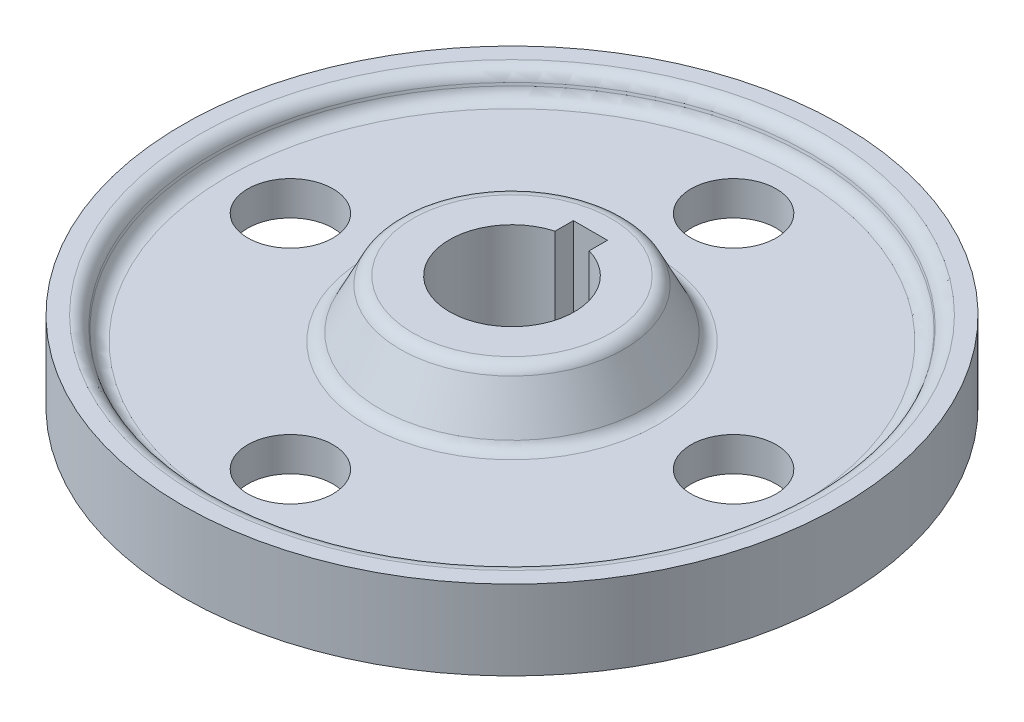
ISO-10303-21;
HEADER;
FILE_DESCRIPTION(('STEP AP214'),'2;1');
FILE_NAME('part.step','',(''),(''),'','','');
FILE_SCHEMA(('AUTOMOTIVE_DESIGN { 1 0 10303 214 1 1 1 1 }'));
ENDSEC;
DATA;
#1=APPLICATION_CONTEXT('core data for automotive mechanical design processes');
#2=APPLICATION_PROTOCOL_DEFINITION('international standard','automotive_design',2000,#1);
#3=PRODUCT_CONTEXT('',#1,'mechanical');
#4=PRODUCT('Part','Part','',(#3));
#5=PRODUCT_RELATED_PRODUCT_CATEGORY('part','',(#4));
#6=PRODUCT_DEFINITION_FORMATION('','',#4);
#7=PRODUCT_DEFINITION_CONTEXT('part definition',#1,'design');
#8=PRODUCT_DEFINITION('design','',#6,#7);
#9=PRODUCT_DEFINITION_SHAPE('','',#8);
#10=(LENGTH_UNIT() NAMED_UNIT(*) SI_UNIT(.MILLI.,.METRE.));
#11=(NAMED_UNIT(*) PLANE_ANGLE_UNIT() SI_UNIT($,.RADIAN.));
#12=(NAMED_UNIT(*) SI_UNIT($,.STERADIAN.) SOLID_ANGLE_UNIT());
#13=UNCERTAINTY_MEASURE_WITH_UNIT(LENGTH_MEASURE(1.E-05),#10,'distance_accuracy_value','');
#14=(GEOMETRIC_REPRESENTATION_CONTEXT(3) GLOBAL_UNCERTAINTY_ASSIGNED_CONTEXT((#13)) GLOBAL_UNIT_ASSIGNED_CONTEXT((#10,
#11,#12)) REPRESENTATION_CONTEXT('',''));
#15=CARTESIAN_POINT('',(0.,0.,0.));
#16=DIRECTION('',(0.,0.,1.));
#17=DIRECTION('',(1.,0.,0.));
#18=AXIS2_PLACEMENT_3D('',#15,#16,#17);
#19=CARTESIAN_POINT('',(0.,13.,0.));
#20=DIRECTION('',(0.,-1.,0.));
#21=DIRECTION('',(0.,0.,-1.));
#22=AXIS2_PLACEMENT_3D('',#19,#20,#21);
#23=CYLINDRICAL_SURFACE('',#22,58.);
#24=CARTESIAN_POINT('',(0.,7.,0.));
#25=DIRECTION('',(0.,1.,0.));
#26=DIRECTION('',(0.,0.,1.));
#27=AXIS2_PLACEMENT_3D('',#24,#25,#26);
#28=CIRCLE('',#27,58.);
#29=CARTESIAN_POINT('',(0.,7.,58.));
#30=VERTEX_POINT('',#29);
#31=EDGE_CURVE('E142',#30,#30,#28,.T.);
#32=ORIENTED_EDGE('',*,*,#31,.F.);
#33=EDGE_LOOP('',(#32));
#34=FACE_BOUND('',#33,.T.);
#35=CARTESIAN_POINT('',(0.,-7.,0.));
#36=DIRECTION('',(0.,1.,0.));
#37=DIRECTION('',(0.,0.,1.));
#38=AXIS2_PLACEMENT_3D('',#35,#36,#37);
#39=CIRCLE('',#38,58.);
#40=CARTESIAN_POINT('',(0.,-7.,58.));
#41=VERTEX_POINT('',#40);
#42=EDGE_CURVE('E99',#41,#41,#39,.T.);
#43=ORIENTED_EDGE('',*,*,#42,.T.);
#44=EDGE_LOOP('',(#43));
#45=FACE_BOUND('',#44,.T.);
#46=ADVANCED_FACE('F37',(#34,#45),#23,.T.);
#47=CARTESIAN_POINT('',(0.,13.,0.));
#48=DIRECTION('',(0.,1.,0.));
#49=DIRECTION('',(0.,0.,1.));
#50=AXIS2_PLACEMENT_3D('',#47,#48,#49);
#51=CONICAL_SURFACE('',#50,55.,0.291456794477867);
#52=CARTESIAN_POINT('',(0.,4.78163028608413,0.));
#53=DIRECTION('',(0.,1.,0.));
#54=DIRECTION('',(0.,0.,1.));
#55=AXIS2_PLACEMENT_3D('',#52,#53,#54);
#56=CIRCLE('',#55,52.5344890858252);
#57=CARTESIAN_POINT('',(0.,4.78163028608413,52.5344890858252));
#58=VERTEX_POINT('',#57);
#59=EDGE_CURVE('E45',#58,#58,#56,.F.);
#60=ORIENTED_EDGE('',*,*,#59,.T.);
#61=EDGE_LOOP('',(#60));
#62=FACE_BOUND('',#61,.T.);
#63=CARTESIAN_POINT('',(0.,5.21836971391586,0.));
#64=DIRECTION('',(0.,1.,0.));
#65=DIRECTION('',(0.,0.,1.));
#66=AXIS2_PLACEMENT_3D('',#63,#64,#65);
#67=CIRCLE('',#66,52.6655109141748);
#68=CARTESIAN_POINT('',(0.,5.21836971391586,52.6655109141748));
#69=VERTEX_POINT('',#68);
#70=EDGE_CURVE('E183',#69,#69,#67,.T.);
#71=ORIENTED_EDGE('',*,*,#70,.T.);
#72=EDGE_LOOP('',(#71));
#73=FACE_BOUND('',#72,.T.);
#74=ADVANCED_FACE('F188',(#62,#73),#51,.F.);
#75=CARTESIAN_POINT('',(0.,13.,0.));
#76=DIRECTION('',(0.,1.,0.));
#77=DIRECTION('',(0.,0.,1.));
#78=AXIS2_PLACEMENT_3D('',#75,#76,#77);
#79=PLANE('',#78);
#80=CARTESIAN_POINT('',(0.,13.,0.));
#81=DIRECTION('',(0.,1.,0.));
#82=DIRECTION('',(0.,0.,1.));
#83=AXIS2_PLACEMENT_3D('',#80,#81,#82);
#84=CIRCLE('',#83,17.4549150281253);
#85=CARTESIAN_POINT('',(0.,13.,17.4549150281253));
#86=VERTEX_POINT('',#85);
#87=EDGE_CURVE('E168',#86,#86,#84,.T.);
#88=ORIENTED_EDGE('',*,*,#87,.T.);
#89=EDGE_LOOP('',(#88));
#90=FACE_BOUND('',#89,.T.);
#91=DIRECTION('',(0.,0.,-1.));
#92=VECTOR('',#91,1.);
#93=CARTESIAN_POINT('',(3.,13.,-8.2));
#94=LINE('',#93,#92);
#95=CARTESIAN_POINT('',(3.,13.,-10.5830052442584));
#96=VERTEX_POINT('',#95);
#97=CARTESIAN_POINT('',(3.,13.,-13.8));
#98=VERTEX_POINT('',#97);
#99=EDGE_CURVE('E81',#96,#98,#94,.T.);
#100=ORIENTED_EDGE('',*,*,#99,.F.);
#101=CARTESIAN_POINT('',(0.,13.,0.));
#102=DIRECTION('',(0.,1.,0.));
#103=DIRECTION('',(0.,0.,1.));
#104=AXIS2_PLACEMENT_3D('',#101,#102,#103);
#105=CIRCLE('',#104,11.);
#106=CARTESIAN_POINT('',(-3.,13.,-10.5830052442584));
#107=VERTEX_POINT('',#106);
#108=EDGE_CURVE('E160',#107,#96,#105,.T.);
#109=ORIENTED_EDGE('',*,*,#108,.F.);
#110=DIRECTION('',(0.,0.,-1.));
#111=VECTOR('',#110,1.);
#112=CARTESIAN_POINT('',(-3.,13.,-8.2));
#113=LINE('',#112,#111);
#114=CARTESIAN_POINT('',(-3.,13.,-13.8));
#115=VERTEX_POINT('',#114);
#116=EDGE_CURVE('E52',#107,#115,#113,.T.);
#117=ORIENTED_EDGE('',*,*,#116,.T.);
#118=DIRECTION('',(-1.,0.,0.));
#119=VECTOR('',#118,1.);
#120=CARTESIAN_POINT('',(3.,13.,-13.8));
#121=LINE('',#120,#119);
#122=EDGE_CURVE('E146',#98,#115,#121,.T.);
#123=ORIENTED_EDGE('',*,*,#122,.F.);
#124=EDGE_LOOP('',(#100,#109,#117,#123));
#125=FACE_BOUND('',#124,.T.);
#126=ADVANCED_FACE('F244',(#90,#125),#79,.T.);
#127=CARTESIAN_POINT('',(0.,0.,0.));
#128=DIRECTION('',(0.,1.,0.));
#129=DIRECTION('',(0.,0.,1.));
#130=AXIS2_PLACEMENT_3D('',#127,#128,#129);
#131=CYLINDRICAL_SURFACE('',#130,11.);
#132=ORIENTED_EDGE('',*,*,#108,.T.);
#133=DIRECTION('',(0.,1.,0.));
#134=VECTOR('',#133,1.);
#135=CARTESIAN_POINT('',(3.,0.,-10.5830052442584));
#136=LINE('',#135,#134);
#137=CARTESIAN_POINT('',(3.,-13.,-10.5830052442584));
#138=VERTEX_POINT('',#137);
#139=EDGE_CURVE('E60',#96,#138,#136,.F.);
#140=ORIENTED_EDGE('',*,*,#139,.T.);
#141=CARTESIAN_POINT('',(0.,-13.,0.));
#142=DIRECTION('',(0.,1.,0.));
#143=DIRECTION('',(0.,0.,1.));
#144=AXIS2_PLACEMENT_3D('',#141,#142,#143);
#145=CIRCLE('',#144,11.);
#146=CARTESIAN_POINT('',(-3.,-13.,-10.5830052442584));
#147=VERTEX_POINT('',#146);
#148=EDGE_CURVE('E98',#147,#138,#145,.T.);
#149=ORIENTED_EDGE('',*,*,#148,.F.);
#150=DIRECTION('',(0.,1.,0.));
#151=VECTOR('',#150,1.);
#152=CARTESIAN_POINT('',(-3.,0.,-10.5830052442584));
#153=LINE('',#152,#151);
#154=EDGE_CURVE('E163',#107,#147,#153,.F.);
#155=ORIENTED_EDGE('',*,*,#154,.F.);
#156=EDGE_LOOP('',(#132,#140,#149,#155));
#157=FACE_BOUND('',#156,.T.);
#158=ADVANCED_FACE('F216',(#157),#131,.F.);
#159=CARTESIAN_POINT('',(39.0000000000011,0.,-1.10367054526908E-12));
#160=DIRECTION('',(0.,1.,0.));
#161=DIRECTION('',(0.,0.,1.));
#162=AXIS2_PLACEMENT_3D('',#159,#160,#161);
#163=CYLINDRICAL_SURFACE('',#162,7.50000000000086);
#164=CARTESIAN_POINT('',(39.0000000000011,3.,-1.10367054526908E-12));
#165=DIRECTION('',(0.,-1.,0.));
#166=DIRECTION('',(0.,0.,-1.));
#167=AXIS2_PLACEMENT_3D('',#164,#165,#166);
#168=CIRCLE('',#167,7.50000000000086);
#169=CARTESIAN_POINT('',(39.0000000000011,3.,-7.50000000000197));
#170=VERTEX_POINT('',#169);
#171=EDGE_CURVE('E157',#170,#170,#168,.F.);
#172=ORIENTED_EDGE('',*,*,#171,.T.);
#173=EDGE_LOOP('',(#172));
#174=FACE_BOUND('',#173,.T.);
#175=CARTESIAN_POINT('',(39.0000000000011,-3.,-1.10367054526908E-12));
#176=DIRECTION('',(0.,-1.,0.));
#177=DIRECTION('',(0.,0.,-1.));
#178=AXIS2_PLACEMENT_3D('',#175,#176,#177);
#179=CIRCLE('',#178,7.50000000000086);
#180=CARTESIAN_POINT('',(39.0000000000011,-3.,-7.50000000000197));
#181=VERTEX_POINT('',#180);
#182=EDGE_CURVE('E112',#181,#181,#179,.F.);
#183=ORIENTED_EDGE('',*,*,#182,.F.);
#184=EDGE_LOOP('',(#183));
#185=FACE_BOUND('',#184,.T.);
#186=ADVANCED_FACE('F212',(#174,#185),#163,.F.);
#187=CARTESIAN_POINT('',(2.20734109053816E-12,0.,39.));
#188=DIRECTION('',(0.,1.,0.));
#189=DIRECTION('',(0.,0.,1.));
#190=AXIS2_PLACEMENT_3D('',#187,#188,#189);
#191=CYLINDRICAL_SURFACE('',#190,7.50000000000237);
#192=CARTESIAN_POINT('',(2.20734109053816E-12,3.,39.));
#193=DIRECTION('',(0.,-1.,0.));
#194=DIRECTION('',(0.,0.,-1.));
#195=AXIS2_PLACEMENT_3D('',#192,#193,#194);
#196=CIRCLE('',#195,7.50000000000237);
#197=CARTESIAN_POINT('',(2.20734109053816E-12,3.,31.4999999999976));
#198=VERTEX_POINT('',#197);
#199=EDGE_CURVE('E154',#198,#198,#196,.F.);
#200=ORIENTED_EDGE('',*,*,#199,.T.);
#201=EDGE_LOOP('',(#200));
#202=FACE_BOUND('',#201,.T.);
#203=CARTESIAN_POINT('',(2.20734109053816E-12,-3.,39.));
#204=DIRECTION('',(0.,-1.,0.));
#205=DIRECTION('',(0.,0.,-1.));
#206=AXIS2_PLACEMENT_3D('',#203,#204,#205);
#207=CIRCLE('',#206,7.50000000000237);
#208=CARTESIAN_POINT('',(2.20734109053816E-12,-3.,31.4999999999976));
#209=VERTEX_POINT('',#208);
#210=EDGE_CURVE('E109',#209,#209,#207,.F.);
#211=ORIENTED_EDGE('',*,*,#210,.F.);
#212=EDGE_LOOP('',(#211));
#213=FACE_BOUND('',#212,.T.);
#214=ADVANCED_FACE('F215',(#202,#213),#191,.F.);
#215=CARTESIAN_POINT('',(-38.9999999999989,0.,1.10844666778576E-12));
#216=DIRECTION('',(0.,1.,0.));
#217=DIRECTION('',(0.,0.,1.));
#218=AXIS2_PLACEMENT_3D('',#215,#216,#217);
#219=CYLINDRICAL_SURFACE('',#218,7.50000000000177);
#220=CARTESIAN_POINT('',(-38.9999999999989,3.,1.10844666778576E-12));
#221=DIRECTION('',(0.,-1.,0.));
#222=DIRECTION('',(0.,0.,-1.));
#223=AXIS2_PLACEMENT_3D('',#220,#221,#222);
#224=CIRCLE('',#223,7.50000000000177);
#225=CARTESIAN_POINT('',(-38.9999999999989,3.,-7.50000000000066));
#226=VERTEX_POINT('',#225);
#227=EDGE_CURVE('E151',#226,#226,#224,.F.);
#228=ORIENTED_EDGE('',*,*,#227,.T.);
#229=EDGE_LOOP('',(#228));
#230=FACE_BOUND('',#229,.T.);
#231=CARTESIAN_POINT('',(-38.9999999999989,-3.,1.10844666778576E-12));
#232=DIRECTION('',(0.,-1.,0.));
#233=DIRECTION('',(0.,0.,-1.));
#234=AXIS2_PLACEMENT_3D('',#231,#232,#233);
#235=CIRCLE('',#234,7.50000000000177);
#236=CARTESIAN_POINT('',(-38.9999999999989,-3.,-7.50000000000066));
#237=VERTEX_POINT('',#236);
#238=EDGE_CURVE('E106',#237,#237,#235,.F.);
#239=ORIENTED_EDGE('',*,*,#238,.F.);
#240=EDGE_LOOP('',(#239));
#241=FACE_BOUND('',#240,.T.);
#242=ADVANCED_FACE('F276',(#230,#241),#219,.F.);
#243=CARTESIAN_POINT('',(0.,0.,-39.));
#244=DIRECTION('',(0.,1.,0.));
#245=DIRECTION('',(0.,0.,1.));
#246=AXIS2_PLACEMENT_3D('',#243,#244,#245);
#247=CYLINDRICAL_SURFACE('',#246,7.5);
#248=CARTESIAN_POINT('',(0.,3.,-39.));
#249=DIRECTION('',(0.,-1.,0.));
#250=DIRECTION('',(0.,0.,-1.));
#251=AXIS2_PLACEMENT_3D('',#248,#249,#250);
#252=CIRCLE('',#251,7.5);
#253=CARTESIAN_POINT('',(0.,3.,-46.5));
#254=VERTEX_POINT('',#253);
#255=EDGE_CURVE('E149',#254,#254,#252,.F.);
#256=ORIENTED_EDGE('',*,*,#255,.T.);
#257=EDGE_LOOP('',(#256));
#258=FACE_BOUND('',#257,.T.);
#259=CARTESIAN_POINT('',(0.,-3.,-39.));
#260=DIRECTION('',(0.,-1.,0.));
#261=DIRECTION('',(0.,0.,-1.));
#262=AXIS2_PLACEMENT_3D('',#259,#260,#261);
#263=CIRCLE('',#262,7.5);
#264=CARTESIAN_POINT('',(0.,-3.,-46.5));
#265=VERTEX_POINT('',#264);
#266=EDGE_CURVE('E105',#265,#265,#263,.F.);
#267=ORIENTED_EDGE('',*,*,#266,.F.);
#268=EDGE_LOOP('',(#267));
#269=FACE_BOUND('',#268,.T.);
#270=ADVANCED_FACE('F201',(#258,#269),#247,.F.);
#271=CARTESIAN_POINT('',(-52.,3.,0.));
#272=DIRECTION('',(0.,-1.,0.));
#273=DIRECTION('',(0.,0.,-1.));
#274=AXIS2_PLACEMENT_3D('',#271,#272,#273);
#275=PLANE('',#274);
#276=CARTESIAN_POINT('',(0.,3.,0.));
#277=DIRECTION('',(0.,-1.,0.));
#278=DIRECTION('',(0.,0.,-1.));
#279=AXIS2_PLACEMENT_3D('',#276,#277,#278);
#280=CIRCLE('',#279,25.5450849718747);
#281=CARTESIAN_POINT('',(0.,3.,-25.5450849718747));
#282=VERTEX_POINT('',#281);
#283=EDGE_CURVE('E180',#282,#282,#280,.T.);
#284=ORIENTED_EDGE('',*,*,#283,.T.);
#285=EDGE_LOOP('',(#284));
#286=FACE_BOUND('',#285,.T.);
#287=CARTESIAN_POINT('',(0.,3.,0.));
#288=DIRECTION('',(0.,-1.,0.));
#289=DIRECTION('',(0.,0.,-1.));
#290=AXIS2_PLACEMENT_3D('',#287,#288,#289);
#291=CIRCLE('',#290,50.1399233727724);
#292=CARTESIAN_POINT('',(0.,3.,-50.1399233727724));
#293=VERTEX_POINT('',#292);
#294=EDGE_CURVE('E177',#293,#293,#291,.F.);
#295=ORIENTED_EDGE('',*,*,#294,.T.);
#296=EDGE_LOOP('',(#295));
#297=FACE_BOUND('',#296,.T.);
#298=ORIENTED_EDGE('',*,*,#199,.F.);
#299=EDGE_LOOP('',(#298));
#300=FACE_BOUND('',#299,.T.);
#301=ORIENTED_EDGE('',*,*,#255,.F.);
#302=EDGE_LOOP('',(#301));
#303=FACE_BOUND('',#302,.T.);
#304=ORIENTED_EDGE('',*,*,#227,.F.);
#305=EDGE_LOOP('',(#304));
#306=FACE_BOUND('',#305,.T.);
#307=ORIENTED_EDGE('',*,*,#171,.F.);
#308=EDGE_LOOP('',(#307));
#309=FACE_BOUND('',#308,.T.);
#310=ADVANCED_FACE('F197',(#286,#297,#300,#303,#306,#309),#275,.F.);
#311=CARTESIAN_POINT('',(0.,3.,0.));
#312=DIRECTION('',(0.,-1.,0.));
#313=DIRECTION('',(0.,0.,-1.));
#314=AXIS2_PLACEMENT_3D('',#311,#312,#313);
#315=CONICAL_SURFACE('',#314,24.,0.463647609000806);
#316=CARTESIAN_POINT('',(0.,11.6180339887499,0.));
#317=DIRECTION('',(0.,-1.,0.));
#318=DIRECTION('',(0.,0.,-1.));
#319=AXIS2_PLACEMENT_3D('',#316,#317,#318);
#320=CIRCLE('',#319,19.690983005625);
#321=CARTESIAN_POINT('',(0.,11.6180339887499,-19.690983005625));
#322=VERTEX_POINT('',#321);
#323=EDGE_CURVE('E174',#322,#322,#320,.T.);
#324=ORIENTED_EDGE('',*,*,#323,.T.);
#325=EDGE_LOOP('',(#324));
#326=FACE_BOUND('',#325,.T.);
#327=CARTESIAN_POINT('',(0.,4.3819660112501,0.));
#328=DIRECTION('',(0.,-1.,0.));
#329=DIRECTION('',(0.,0.,-1.));
#330=AXIS2_PLACEMENT_3D('',#327,#328,#329);
#331=CIRCLE('',#330,23.3090169943749);
#332=CARTESIAN_POINT('',(0.,4.3819660112501,-23.3090169943749));
#333=VERTEX_POINT('',#332);
#334=EDGE_CURVE('E171',#333,#333,#331,.F.);
#335=ORIENTED_EDGE('',*,*,#334,.T.);
#336=EDGE_LOOP('',(#335));
#337=FACE_BOUND('',#336,.T.);
#338=ADVANCED_FACE('F200',(#326,#337),#315,.T.);
#339=CARTESIAN_POINT('',(3.,0.,-8.2));
#340=DIRECTION('',(1.,0.,0.));
#341=DIRECTION('',(0.,0.,-1.));
#342=AXIS2_PLACEMENT_3D('',#339,#340,#341);
#343=PLANE('',#342);
#344=ORIENTED_EDGE('',*,*,#99,.T.);
#345=DIRECTION('',(0.,1.,0.));
#346=VECTOR('',#345,1.);
#347=CARTESIAN_POINT('',(3.,0.,-13.8));
#348=LINE('',#347,#346);
#349=CARTESIAN_POINT('',(3.,-13.,-13.8));
#350=VERTEX_POINT('',#349);
#351=EDGE_CURVE('E76',#350,#98,#348,.T.);
#352=ORIENTED_EDGE('',*,*,#351,.F.);
#353=DIRECTION('',(0.,0.,-1.));
#354=VECTOR('',#353,1.);
#355=CARTESIAN_POINT('',(3.,-13.,-8.2));
#356=LINE('',#355,#354);
#357=EDGE_CURVE('E80',#138,#350,#356,.T.);
#358=ORIENTED_EDGE('',*,*,#357,.F.);
#359=ORIENTED_EDGE('',*,*,#139,.F.);
#360=EDGE_LOOP('',(#344,#352,#358,#359));
#361=FACE_BOUND('',#360,.T.);
#362=ADVANCED_FACE('F78',(#361),#343,.F.);
#363=CARTESIAN_POINT('',(-3.,0.,-8.2));
#364=DIRECTION('',(1.,0.,0.));
#365=DIRECTION('',(0.,0.,-1.));
#366=AXIS2_PLACEMENT_3D('',#363,#364,#365);
#367=PLANE('',#366);
#368=ORIENTED_EDGE('',*,*,#154,.T.);
#369=DIRECTION('',(0.,0.,-1.));
#370=VECTOR('',#369,1.);
#371=CARTESIAN_POINT('',(-3.,-13.,-8.2));
#372=LINE('',#371,#370);
#373=CARTESIAN_POINT('',(-3.,-13.,-13.8));
#374=VERTEX_POINT('',#373);
#375=EDGE_CURVE('E93',#147,#374,#372,.T.);
#376=ORIENTED_EDGE('',*,*,#375,.T.);
#377=DIRECTION('',(0.,1.,0.));
#378=VECTOR('',#377,1.);
#379=CARTESIAN_POINT('',(-3.,0.,-13.8));
#380=LINE('',#379,#378);
#381=EDGE_CURVE('E85',#374,#115,#380,.T.);
#382=ORIENTED_EDGE('',*,*,#381,.T.);
#383=ORIENTED_EDGE('',*,*,#116,.F.);
#384=EDGE_LOOP('',(#368,#376,#382,#383));
#385=FACE_BOUND('',#384,.T.);
#386=ADVANCED_FACE('F270',(#385),#367,.T.);
#387=CARTESIAN_POINT('',(3.,0.,-13.8));
#388=DIRECTION('',(0.,0.,-1.));
#389=DIRECTION('',(-1.,0.,0.));
#390=AXIS2_PLACEMENT_3D('',#387,#388,#389);
#391=PLANE('',#390);
#392=ORIENTED_EDGE('',*,*,#122,.T.);
#393=ORIENTED_EDGE('',*,*,#381,.F.);
#394=DIRECTION('',(-1.,0.,0.));
#395=VECTOR('',#394,1.);
#396=CARTESIAN_POINT('',(3.,-13.,-13.8));
#397=LINE('',#396,#395);
#398=EDGE_CURVE('E88',#350,#374,#397,.T.);
#399=ORIENTED_EDGE('',*,*,#398,.F.);
#400=ORIENTED_EDGE('',*,*,#351,.T.);
#401=EDGE_LOOP('',(#392,#393,#399,#400));
#402=FACE_BOUND('',#401,.T.);
#403=ADVANCED_FACE('F89',(#402),#391,.F.);
#404=CARTESIAN_POINT('',(0.,7.,0.));
#405=DIRECTION('',(0.,1.,0.));
#406=DIRECTION('',(0.,0.,1.));
#407=AXIS2_PLACEMENT_3D('',#404,#405,#406);
#408=PLANE('',#407);
#409=CARTESIAN_POINT('',(0.,7.,0.));
#410=DIRECTION('',(0.,1.,0.));
#411=DIRECTION('',(0.,0.,1.));
#412=AXIS2_PLACEMENT_3D('',#409,#410,#411);
#413=CIRCLE('',#412,55.0600766272276);
#414=CARTESIAN_POINT('',(0.,7.,55.0600766272276));
#415=VERTEX_POINT('',#414);
#416=EDGE_CURVE('E11',#415,#415,#413,.F.);
#417=ORIENTED_EDGE('',*,*,#416,.T.);
#418=EDGE_LOOP('',(#417));
#419=FACE_BOUND('',#418,.T.);
#420=ORIENTED_EDGE('',*,*,#31,.T.);
#421=EDGE_LOOP('',(#420));
#422=FACE_BOUND('',#421,.T.);
#423=ADVANCED_FACE('F254',(#419,#422),#408,.T.);
#424=CARTESIAN_POINT('',(0.,10.5,0.));
#425=DIRECTION('',(0.,1.,0.));
#426=DIRECTION('',(0.,0.,1.));
#427=AXIS2_PLACEMENT_3D('',#424,#425,#426);
#428=TOROIDAL_SURFACE('',#427,17.4549150281253,2.5);
#429=ORIENTED_EDGE('',*,*,#323,.F.);
#430=EDGE_LOOP('',(#429));
#431=FACE_BOUND('',#430,.T.);
#432=ORIENTED_EDGE('',*,*,#87,.F.);
#433=EDGE_LOOP('',(#432));
#434=FACE_BOUND('',#433,.T.);
#435=ADVANCED_FACE('F251',(#431,#434),#428,.T.);
#436=CARTESIAN_POINT('',(0.,5.5,0.));
#437=DIRECTION('',(0.,-1.,0.));
#438=DIRECTION('',(0.,0.,-1.));
#439=AXIS2_PLACEMENT_3D('',#436,#437,#438);
#440=TOROIDAL_SURFACE('',#439,25.5450849718747,2.5);
#441=ORIENTED_EDGE('',*,*,#283,.F.);
#442=EDGE_LOOP('',(#441));
#443=FACE_BOUND('',#442,.T.);
#444=ORIENTED_EDGE('',*,*,#334,.F.);
#445=EDGE_LOOP('',(#444));
#446=FACE_BOUND('',#445,.T.);
#447=ADVANCED_FACE('F194',(#443,#446),#440,.F.);
#448=CARTESIAN_POINT('',(0.,5.5,0.));
#449=DIRECTION('',(0.,-1.,0.));
#450=DIRECTION('',(0.,0.,-1.));
#451=AXIS2_PLACEMENT_3D('',#448,#449,#450);
#452=TOROIDAL_SURFACE('',#451,50.1399233727724,2.5);
#453=ORIENTED_EDGE('',*,*,#59,.F.);
#454=EDGE_LOOP('',(#453));
#455=FACE_BOUND('',#454,.T.);
#456=ORIENTED_EDGE('',*,*,#294,.F.);
#457=EDGE_LOOP('',(#456));
#458=FACE_BOUND('',#457,.T.);
#459=ADVANCED_FACE('F191',(#455,#458),#452,.F.);
#460=CARTESIAN_POINT('',(0.,4.5,0.));
#461=DIRECTION('',(0.,1.,0.));
#462=DIRECTION('',(0.,0.,1.));
#463=AXIS2_PLACEMENT_3D('',#460,#461,#462);
#464=TOROIDAL_SURFACE('',#463,55.0600766272276,2.5);
#465=ORIENTED_EDGE('',*,*,#70,.F.);
#466=EDGE_LOOP('',(#465));
#467=FACE_BOUND('',#466,.T.);
#468=ORIENTED_EDGE('',*,*,#416,.F.);
#469=EDGE_LOOP('',(#468));
#470=FACE_BOUND('',#469,.T.);
#471=ADVANCED_FACE('F39',(#467,#470),#464,.T.);
#472=CARTESIAN_POINT('',(0.,-13.,0.));
#473=DIRECTION('',(0.,-1.,0.));
#474=DIRECTION('',(0.,0.,1.));
#475=AXIS2_PLACEMENT_3D('',#472,#473,#474);
#476=CONICAL_SURFACE('',#475,55.,0.291456794477867);
#477=CARTESIAN_POINT('',(0.,-4.78163028608413,0.));
#478=DIRECTION('',(0.,1.,0.));
#479=DIRECTION('',(0.,0.,1.));
#480=AXIS2_PLACEMENT_3D('',#477,#478,#479);
#481=CIRCLE('',#480,52.5344890858252);
#482=CARTESIAN_POINT('',(0.,-4.78163028608413,52.5344890858252));
#483=VERTEX_POINT('',#482);
#484=EDGE_CURVE('E136',#483,#483,#481,.F.);
#485=ORIENTED_EDGE('',*,*,#484,.F.);
#486=EDGE_LOOP('',(#485));
#487=FACE_BOUND('',#486,.T.);
#488=CARTESIAN_POINT('',(0.,-5.21836971391586,0.));
#489=DIRECTION('',(0.,1.,0.));
#490=DIRECTION('',(0.,0.,1.));
#491=AXIS2_PLACEMENT_3D('',#488,#489,#490);
#492=CIRCLE('',#491,52.6655109141748);
#493=CARTESIAN_POINT('',(0.,-5.21836971391586,52.6655109141748));
#494=VERTEX_POINT('',#493);
#495=EDGE_CURVE('E133',#494,#494,#492,.T.);
#496=ORIENTED_EDGE('',*,*,#495,.F.);
#497=EDGE_LOOP('',(#496));
#498=FACE_BOUND('',#497,.T.);
#499=ADVANCED_FACE('F232',(#487,#498),#476,.F.);
#500=CARTESIAN_POINT('',(0.,-13.,0.));
#501=DIRECTION('',(0.,-1.,0.));
#502=DIRECTION('',(0.,0.,1.));
#503=AXIS2_PLACEMENT_3D('',#500,#501,#502);
#504=PLANE('',#503);
#505=CARTESIAN_POINT('',(0.,-13.,0.));
#506=DIRECTION('',(0.,1.,0.));
#507=DIRECTION('',(0.,0.,1.));
#508=AXIS2_PLACEMENT_3D('',#505,#506,#507);
#509=CIRCLE('',#508,17.4549150281253);
#510=CARTESIAN_POINT('',(0.,-13.,17.4549150281253));
#511=VERTEX_POINT('',#510);
#512=EDGE_CURVE('E116',#511,#511,#509,.T.);
#513=ORIENTED_EDGE('',*,*,#512,.F.);
#514=EDGE_LOOP('',(#513));
#515=FACE_BOUND('',#514,.T.);
#516=ORIENTED_EDGE('',*,*,#357,.T.);
#517=ORIENTED_EDGE('',*,*,#398,.T.);
#518=ORIENTED_EDGE('',*,*,#375,.F.);
#519=ORIENTED_EDGE('',*,*,#148,.T.);
#520=EDGE_LOOP('',(#516,#517,#518,#519));
#521=FACE_BOUND('',#520,.T.);
#522=ADVANCED_FACE('F96',(#515,#521),#504,.T.);
#523=CARTESIAN_POINT('',(-52.,-3.,0.));
#524=DIRECTION('',(0.,1.,0.));
#525=DIRECTION('',(0.,0.,-1.));
#526=AXIS2_PLACEMENT_3D('',#523,#524,#525);
#527=PLANE('',#526);
#528=CARTESIAN_POINT('',(0.,-3.,0.));
#529=DIRECTION('',(0.,-1.,0.));
#530=DIRECTION('',(0.,0.,-1.));
#531=AXIS2_PLACEMENT_3D('',#528,#529,#530);
#532=CIRCLE('',#531,25.5450849718747);
#533=CARTESIAN_POINT('',(0.,-3.,-25.5450849718747));
#534=VERTEX_POINT('',#533);
#535=EDGE_CURVE('E130',#534,#534,#532,.T.);
#536=ORIENTED_EDGE('',*,*,#535,.F.);
#537=EDGE_LOOP('',(#536));
#538=FACE_BOUND('',#537,.T.);
#539=CARTESIAN_POINT('',(0.,-3.,0.));
#540=DIRECTION('',(0.,-1.,0.));
#541=DIRECTION('',(0.,0.,-1.));
#542=AXIS2_PLACEMENT_3D('',#539,#540,#541);
#543=CIRCLE('',#542,50.1399233727724);
#544=CARTESIAN_POINT('',(0.,-3.,-50.1399233727724));
#545=VERTEX_POINT('',#544);
#546=EDGE_CURVE('E127',#545,#545,#543,.F.);
#547=ORIENTED_EDGE('',*,*,#546,.F.);
#548=EDGE_LOOP('',(#547));
#549=FACE_BOUND('',#548,.T.);
#550=ORIENTED_EDGE('',*,*,#210,.T.);
#551=EDGE_LOOP('',(#550));
#552=FACE_BOUND('',#551,.T.);
#553=ORIENTED_EDGE('',*,*,#266,.T.);
#554=EDGE_LOOP('',(#553));
#555=FACE_BOUND('',#554,.T.);
#556=ORIENTED_EDGE('',*,*,#238,.T.);
#557=EDGE_LOOP('',(#556));
#558=FACE_BOUND('',#557,.T.);
#559=ORIENTED_EDGE('',*,*,#182,.T.);
#560=EDGE_LOOP('',(#559));
#561=FACE_BOUND('',#560,.T.);
#562=ADVANCED_FACE('F220',(#538,#549,#552,#555,#558,#561),#527,.F.);
#563=CARTESIAN_POINT('',(0.,-3.,0.));
#564=DIRECTION('',(0.,1.,0.));
#565=DIRECTION('',(0.,0.,-1.));
#566=AXIS2_PLACEMENT_3D('',#563,#564,#565);
#567=CONICAL_SURFACE('',#566,24.,0.463647609000806);
#568=CARTESIAN_POINT('',(0.,-11.6180339887499,0.));
#569=DIRECTION('',(0.,-1.,0.));
#570=DIRECTION('',(0.,0.,-1.));
#571=AXIS2_PLACEMENT_3D('',#568,#569,#570);
#572=CIRCLE('',#571,19.690983005625);
#573=CARTESIAN_POINT('',(0.,-11.6180339887499,-19.690983005625));
#574=VERTEX_POINT('',#573);
#575=EDGE_CURVE('E124',#574,#574,#572,.T.);
#576=ORIENTED_EDGE('',*,*,#575,.F.);
#577=EDGE_LOOP('',(#576));
#578=FACE_BOUND('',#577,.T.);
#579=CARTESIAN_POINT('',(0.,-4.3819660112501,0.));
#580=DIRECTION('',(0.,-1.,0.));
#581=DIRECTION('',(0.,0.,-1.));
#582=AXIS2_PLACEMENT_3D('',#579,#580,#581);
#583=CIRCLE('',#582,23.3090169943749);
#584=CARTESIAN_POINT('',(0.,-4.3819660112501,-23.3090169943749));
#585=VERTEX_POINT('',#584);
#586=EDGE_CURVE('E121',#585,#585,#583,.F.);
#587=ORIENTED_EDGE('',*,*,#586,.F.);
#588=EDGE_LOOP('',(#587));
#589=FACE_BOUND('',#588,.T.);
#590=ADVANCED_FACE('F222',(#578,#589),#567,.T.);
#591=CARTESIAN_POINT('',(0.,-7.,0.));
#592=DIRECTION('',(0.,-1.,0.));
#593=DIRECTION('',(0.,0.,1.));
#594=AXIS2_PLACEMENT_3D('',#591,#592,#593);
#595=PLANE('',#594);
#596=CARTESIAN_POINT('',(0.,-7.,0.));
#597=DIRECTION('',(0.,1.,0.));
#598=DIRECTION('',(0.,0.,1.));
#599=AXIS2_PLACEMENT_3D('',#596,#597,#598);
#600=CIRCLE('',#599,55.0600766272276);
#601=CARTESIAN_POINT('',(0.,-7.,55.0600766272276));
#602=VERTEX_POINT('',#601);
#603=EDGE_CURVE('E139',#602,#602,#600,.F.);
#604=ORIENTED_EDGE('',*,*,#603,.F.);
#605=EDGE_LOOP('',(#604));
#606=FACE_BOUND('',#605,.T.);
#607=ORIENTED_EDGE('',*,*,#42,.F.);
#608=EDGE_LOOP('',(#607));
#609=FACE_BOUND('',#608,.T.);
#610=ADVANCED_FACE('F229',(#606,#609),#595,.T.);
#611=CARTESIAN_POINT('',(0.,-10.5,0.));
#612=DIRECTION('',(0.,-1.,0.));
#613=DIRECTION('',(0.,0.,1.));
#614=AXIS2_PLACEMENT_3D('',#611,#612,#613);
#615=TOROIDAL_SURFACE('',#614,17.4549150281253,2.5);
#616=ORIENTED_EDGE('',*,*,#575,.T.);
#617=EDGE_LOOP('',(#616));
#618=FACE_BOUND('',#617,.T.);
#619=ORIENTED_EDGE('',*,*,#512,.T.);
#620=EDGE_LOOP('',(#619));
#621=FACE_BOUND('',#620,.T.);
#622=ADVANCED_FACE('F311',(#618,#621),#615,.T.);
#623=CARTESIAN_POINT('',(0.,-5.5,0.));
#624=DIRECTION('',(0.,1.,0.));
#625=DIRECTION('',(0.,0.,-1.));
#626=AXIS2_PLACEMENT_3D('',#623,#624,#625);
#627=TOROIDAL_SURFACE('',#626,25.5450849718747,2.5);
#628=ORIENTED_EDGE('',*,*,#535,.T.);
#629=EDGE_LOOP('',(#628));
#630=FACE_BOUND('',#629,.T.);
#631=ORIENTED_EDGE('',*,*,#586,.T.);
#632=EDGE_LOOP('',(#631));
#633=FACE_BOUND('',#632,.T.);
#634=ADVANCED_FACE('F307',(#630,#633),#627,.F.);
#635=CARTESIAN_POINT('',(0.,-5.5,0.));
#636=DIRECTION('',(0.,1.,0.));
#637=DIRECTION('',(0.,0.,-1.));
#638=AXIS2_PLACEMENT_3D('',#635,#636,#637);
#639=TOROIDAL_SURFACE('',#638,50.1399233727724,2.5);
#640=ORIENTED_EDGE('',*,*,#484,.T.);
#641=EDGE_LOOP('',(#640));
#642=FACE_BOUND('',#641,.T.);
#643=ORIENTED_EDGE('',*,*,#546,.T.);
#644=EDGE_LOOP('',(#643));
#645=FACE_BOUND('',#644,.T.);
#646=ADVANCED_FACE('F303',(#642,#645),#639,.F.);
#647=CARTESIAN_POINT('',(0.,-4.5,0.));
#648=DIRECTION('',(0.,-1.,0.));
#649=DIRECTION('',(0.,0.,1.));
#650=AXIS2_PLACEMENT_3D('',#647,#648,#649);
#651=TOROIDAL_SURFACE('',#650,55.0600766272276,2.5);
#652=ORIENTED_EDGE('',*,*,#495,.T.);
#653=EDGE_LOOP('',(#652));
#654=FACE_BOUND('',#653,.T.);
#655=ORIENTED_EDGE('',*,*,#603,.T.);
#656=EDGE_LOOP('',(#655));
#657=FACE_BOUND('',#656,.T.);
#658=ADVANCED_FACE('F300',(#654,#657),#651,.T.);
#659=CLOSED_SHELL('',(#46,#74,#126,#158,#186,#214,#242,#270,#310,#338,#362,#386,#403,#423,#435,
#447,#459,#471,#499,#522,#562,#590,#610,#622,#634,#646,#658));
#660=MANIFOLD_SOLID_BREP('B2',#659);
#661=ADVANCED_BREP_SHAPE_REPRESENTATION('',(#18,#660),#14);
#662=SHAPE_DEFINITION_REPRESENTATION(#9,#661);
ENDSEC;
END-ISO-10303-21;
